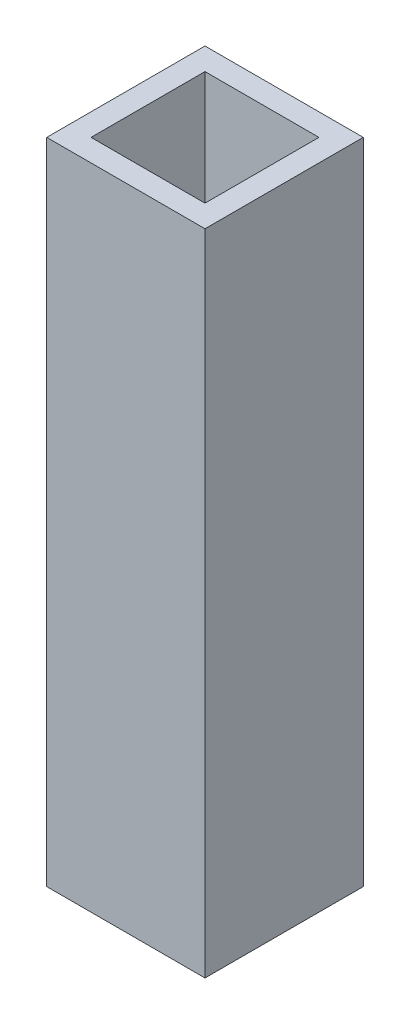
ISO-10303-21;
HEADER;
FILE_DESCRIPTION(('STEP AP214'),'2;1');
FILE_NAME('part.step','',(''),(''),'','','');
FILE_SCHEMA(('AUTOMOTIVE_DESIGN { 1 0 10303 214 1 1 1 1 }'));
ENDSEC;
DATA;
#1=APPLICATION_CONTEXT('core data for automotive mechanical design processes');
#2=APPLICATION_PROTOCOL_DEFINITION('international standard','automotive_design',2000,#1);
#3=PRODUCT_CONTEXT('',#1,'mechanical');
#4=PRODUCT('Part','Part','',(#3));
#5=PRODUCT_RELATED_PRODUCT_CATEGORY('part','',(#4));
#6=PRODUCT_DEFINITION_FORMATION('','',#4);
#7=PRODUCT_DEFINITION_CONTEXT('part definition',#1,'design');
#8=PRODUCT_DEFINITION('design','',#6,#7);
#9=PRODUCT_DEFINITION_SHAPE('','',#8);
#10=(LENGTH_UNIT() NAMED_UNIT(*) SI_UNIT(.MILLI.,.METRE.));
#11=(NAMED_UNIT(*) PLANE_ANGLE_UNIT() SI_UNIT($,.RADIAN.));
#12=(NAMED_UNIT(*) SI_UNIT($,.STERADIAN.) SOLID_ANGLE_UNIT());
#13=UNCERTAINTY_MEASURE_WITH_UNIT(LENGTH_MEASURE(1.E-05),#10,'distance_accuracy_value','');
#14=(GEOMETRIC_REPRESENTATION_CONTEXT(3) GLOBAL_UNCERTAINTY_ASSIGNED_CONTEXT((#13)) GLOBAL_UNIT_ASSIGNED_CONTEXT((#10,
#11,#12)) REPRESENTATION_CONTEXT('',''));
#15=CARTESIAN_POINT('',(0.,0.,0.));
#16=DIRECTION('',(0.,0.,1.));
#17=DIRECTION('',(1.,0.,0.));
#18=AXIS2_PLACEMENT_3D('',#15,#16,#17);
#19=CARTESIAN_POINT('',(0.,205.,0.));
#20=DIRECTION('',(0.,1.,0.));
#21=DIRECTION('',(0.,0.,1.));
#22=AXIS2_PLACEMENT_3D('',#19,#20,#21);
#23=PLANE('',#22);
#24=DIRECTION('',(0.,0.,-1.));
#25=VECTOR('',#24,1.);
#26=CARTESIAN_POINT('',(25.,205.,-25.));
#27=LINE('',#26,#25);
#28=CARTESIAN_POINT('',(25.,205.,25.));
#29=VERTEX_POINT('',#28);
#30=CARTESIAN_POINT('',(25.,205.,-25.));
#31=VERTEX_POINT('',#30);
#32=EDGE_CURVE('E153',#29,#31,#27,.T.);
#33=ORIENTED_EDGE('',*,*,#32,.T.);
#34=DIRECTION('',(-1.,0.,0.));
#35=VECTOR('',#34,1.);
#36=CARTESIAN_POINT('',(-25.,205.,-25.));
#37=LINE('',#36,#35);
#38=CARTESIAN_POINT('',(-25.,205.,-25.));
#39=VERTEX_POINT('',#38);
#40=EDGE_CURVE('E157',#31,#39,#37,.T.);
#41=ORIENTED_EDGE('',*,*,#40,.T.);
#42=DIRECTION('',(0.,0.,1.));
#43=VECTOR('',#42,1.);
#44=CARTESIAN_POINT('',(-25.,205.,-25.));
#45=LINE('',#44,#43);
#46=CARTESIAN_POINT('',(-25.,205.,25.));
#47=VERTEX_POINT('',#46);
#48=EDGE_CURVE('E161',#39,#47,#45,.T.);
#49=ORIENTED_EDGE('',*,*,#48,.T.);
#50=DIRECTION('',(1.,0.,0.));
#51=VECTOR('',#50,1.);
#52=CARTESIAN_POINT('',(-25.,205.,25.));
#53=LINE('',#52,#51);
#54=EDGE_CURVE('E164',#47,#29,#53,.T.);
#55=ORIENTED_EDGE('',*,*,#54,.T.);
#56=EDGE_LOOP('',(#33,#41,#49,#55));
#57=FACE_BOUND('',#56,.T.);
#58=DIRECTION('',(1.,0.,0.));
#59=VECTOR('',#58,1.);
#60=CARTESIAN_POINT('',(-18.,205.,18.));
#61=LINE('',#60,#59);
#62=CARTESIAN_POINT('',(-18.,205.,18.));
#63=VERTEX_POINT('',#62);
#64=CARTESIAN_POINT('',(18.,205.,18.));
#65=VERTEX_POINT('',#64);
#66=EDGE_CURVE('E114',#63,#65,#61,.T.);
#67=ORIENTED_EDGE('',*,*,#66,.F.);
#68=DIRECTION('',(0.,0.,1.));
#69=VECTOR('',#68,1.);
#70=CARTESIAN_POINT('',(-18.,205.,-18.));
#71=LINE('',#70,#69);
#72=CARTESIAN_POINT('',(-18.,205.,-18.));
#73=VERTEX_POINT('',#72);
#74=EDGE_CURVE('E105',#73,#63,#71,.T.);
#75=ORIENTED_EDGE('',*,*,#74,.F.);
#76=DIRECTION('',(-1.,0.,0.));
#77=VECTOR('',#76,1.);
#78=CARTESIAN_POINT('',(-18.,205.,-18.));
#79=LINE('',#78,#77);
#80=CARTESIAN_POINT('',(18.,205.,-18.));
#81=VERTEX_POINT('',#80);
#82=EDGE_CURVE('E131',#81,#73,#79,.T.);
#83=ORIENTED_EDGE('',*,*,#82,.F.);
#84=DIRECTION('',(0.,0.,-1.));
#85=VECTOR('',#84,1.);
#86=CARTESIAN_POINT('',(18.,205.,-18.));
#87=LINE('',#86,#85);
#88=EDGE_CURVE('E127',#65,#81,#87,.T.);
#89=ORIENTED_EDGE('',*,*,#88,.F.);
#90=EDGE_LOOP('',(#67,#75,#83,#89));
#91=FACE_BOUND('',#90,.T.);
#92=ADVANCED_FACE('F39',(#57,#91),#23,.T.);
#93=CARTESIAN_POINT('',(0.,0.,0.));
#94=DIRECTION('',(0.,1.,0.));
#95=DIRECTION('',(0.,0.,1.));
#96=AXIS2_PLACEMENT_3D('',#93,#94,#95);
#97=PLANE('',#96);
#98=DIRECTION('',(0.,0.,-1.));
#99=VECTOR('',#98,1.);
#100=CARTESIAN_POINT('',(25.,0.,-25.));
#101=LINE('',#100,#99);
#102=CARTESIAN_POINT('',(25.,0.,25.));
#103=VERTEX_POINT('',#102);
#104=CARTESIAN_POINT('',(25.,0.,-25.));
#105=VERTEX_POINT('',#104);
#106=EDGE_CURVE('E123',#103,#105,#101,.T.);
#107=ORIENTED_EDGE('',*,*,#106,.F.);
#108=DIRECTION('',(1.,0.,0.));
#109=VECTOR('',#108,1.);
#110=CARTESIAN_POINT('',(-25.,0.,25.));
#111=LINE('',#110,#109);
#112=CARTESIAN_POINT('',(-25.,0.,25.));
#113=VERTEX_POINT('',#112);
#114=EDGE_CURVE('E158',#113,#103,#111,.T.);
#115=ORIENTED_EDGE('',*,*,#114,.F.);
#116=DIRECTION('',(0.,0.,1.));
#117=VECTOR('',#116,1.);
#118=CARTESIAN_POINT('',(-25.,0.,-25.));
#119=LINE('',#118,#117);
#120=CARTESIAN_POINT('',(-25.,0.,-25.));
#121=VERTEX_POINT('',#120);
#122=EDGE_CURVE('E174',#121,#113,#119,.T.);
#123=ORIENTED_EDGE('',*,*,#122,.F.);
#124=DIRECTION('',(-1.,0.,0.));
#125=VECTOR('',#124,1.);
#126=CARTESIAN_POINT('',(-25.,0.,-25.));
#127=LINE('',#126,#125);
#128=EDGE_CURVE('E171',#105,#121,#127,.T.);
#129=ORIENTED_EDGE('',*,*,#128,.F.);
#130=EDGE_LOOP('',(#107,#115,#123,#129));
#131=FACE_BOUND('',#130,.T.);
#132=DIRECTION('',(0.,0.,1.));
#133=VECTOR('',#132,1.);
#134=CARTESIAN_POINT('',(-18.,0.,-18.));
#135=LINE('',#134,#133);
#136=CARTESIAN_POINT('',(-18.,0.,-18.));
#137=VERTEX_POINT('',#136);
#138=CARTESIAN_POINT('',(-18.,0.,18.));
#139=VERTEX_POINT('',#138);
#140=EDGE_CURVE('E63',#137,#139,#135,.T.);
#141=ORIENTED_EDGE('',*,*,#140,.T.);
#142=DIRECTION('',(1.,0.,0.));
#143=VECTOR('',#142,1.);
#144=CARTESIAN_POINT('',(-18.,0.,18.));
#145=LINE('',#144,#143);
#146=CARTESIAN_POINT('',(18.,0.,18.));
#147=VERTEX_POINT('',#146);
#148=EDGE_CURVE('E121',#139,#147,#145,.T.);
#149=ORIENTED_EDGE('',*,*,#148,.T.);
#150=DIRECTION('',(0.,0.,-1.));
#151=VECTOR('',#150,1.);
#152=CARTESIAN_POINT('',(18.,0.,-18.));
#153=LINE('',#152,#151);
#154=CARTESIAN_POINT('',(18.,0.,-18.));
#155=VERTEX_POINT('',#154);
#156=EDGE_CURVE('E140',#147,#155,#153,.T.);
#157=ORIENTED_EDGE('',*,*,#156,.T.);
#158=DIRECTION('',(-1.,0.,0.));
#159=VECTOR('',#158,1.);
#160=CARTESIAN_POINT('',(-18.,0.,-18.));
#161=LINE('',#160,#159);
#162=EDGE_CURVE('E115',#155,#137,#161,.T.);
#163=ORIENTED_EDGE('',*,*,#162,.T.);
#164=EDGE_LOOP('',(#141,#149,#157,#163));
#165=FACE_BOUND('',#164,.T.);
#166=ADVANCED_FACE('F197',(#131,#165),#97,.F.);
#167=CARTESIAN_POINT('',(25.,205.,-25.));
#168=DIRECTION('',(-1.,0.,0.));
#169=DIRECTION('',(0.,0.,1.));
#170=AXIS2_PLACEMENT_3D('',#167,#168,#169);
#171=PLANE('',#170);
#172=ORIENTED_EDGE('',*,*,#106,.T.);
#173=DIRECTION('',(0.,-1.,0.));
#174=VECTOR('',#173,1.);
#175=CARTESIAN_POINT('',(25.,205.,-25.));
#176=LINE('',#175,#174);
#177=EDGE_CURVE('E11',#31,#105,#176,.T.);
#178=ORIENTED_EDGE('',*,*,#177,.F.);
#179=ORIENTED_EDGE('',*,*,#32,.F.);
#180=DIRECTION('',(0.,-1.,0.));
#181=VECTOR('',#180,1.);
#182=CARTESIAN_POINT('',(25.,205.,25.));
#183=LINE('',#182,#181);
#184=EDGE_CURVE('E167',#29,#103,#183,.T.);
#185=ORIENTED_EDGE('',*,*,#184,.T.);
#186=EDGE_LOOP('',(#172,#178,#179,#185));
#187=FACE_BOUND('',#186,.T.);
#188=ADVANCED_FACE('F41',(#187),#171,.F.);
#189=CARTESIAN_POINT('',(-25.,205.,-25.));
#190=DIRECTION('',(0.,0.,1.));
#191=DIRECTION('',(1.,0.,0.));
#192=AXIS2_PLACEMENT_3D('',#189,#190,#191);
#193=PLANE('',#192);
#194=ORIENTED_EDGE('',*,*,#128,.T.);
#195=DIRECTION('',(0.,-1.,0.));
#196=VECTOR('',#195,1.);
#197=CARTESIAN_POINT('',(-25.,205.,-25.));
#198=LINE('',#197,#196);
#199=EDGE_CURVE('E48',#39,#121,#198,.T.);
#200=ORIENTED_EDGE('',*,*,#199,.F.);
#201=ORIENTED_EDGE('',*,*,#40,.F.);
#202=ORIENTED_EDGE('',*,*,#177,.T.);
#203=EDGE_LOOP('',(#194,#200,#201,#202));
#204=FACE_BOUND('',#203,.T.);
#205=ADVANCED_FACE('F207',(#204),#193,.F.);
#206=CARTESIAN_POINT('',(-25.,205.,-25.));
#207=DIRECTION('',(1.,0.,0.));
#208=DIRECTION('',(0.,0.,-1.));
#209=AXIS2_PLACEMENT_3D('',#206,#207,#208);
#210=PLANE('',#209);
#211=ORIENTED_EDGE('',*,*,#122,.T.);
#212=DIRECTION('',(0.,-1.,0.));
#213=VECTOR('',#212,1.);
#214=CARTESIAN_POINT('',(-25.,205.,25.));
#215=LINE('',#214,#213);
#216=EDGE_CURVE('E182',#47,#113,#215,.T.);
#217=ORIENTED_EDGE('',*,*,#216,.F.);
#218=ORIENTED_EDGE('',*,*,#48,.F.);
#219=ORIENTED_EDGE('',*,*,#199,.T.);
#220=EDGE_LOOP('',(#211,#217,#218,#219));
#221=FACE_BOUND('',#220,.T.);
#222=ADVANCED_FACE('F191',(#221),#210,.F.);
#223=CARTESIAN_POINT('',(-25.,205.,25.));
#224=DIRECTION('',(0.,0.,-1.));
#225=DIRECTION('',(-1.,0.,0.));
#226=AXIS2_PLACEMENT_3D('',#223,#224,#225);
#227=PLANE('',#226);
#228=ORIENTED_EDGE('',*,*,#114,.T.);
#229=ORIENTED_EDGE('',*,*,#184,.F.);
#230=ORIENTED_EDGE('',*,*,#54,.F.);
#231=ORIENTED_EDGE('',*,*,#216,.T.);
#232=EDGE_LOOP('',(#228,#229,#230,#231));
#233=FACE_BOUND('',#232,.T.);
#234=ADVANCED_FACE('F201',(#233),#227,.F.);
#235=CARTESIAN_POINT('',(-18.,205.,-18.));
#236=DIRECTION('',(1.,0.,0.));
#237=DIRECTION('',(0.,0.,-1.));
#238=AXIS2_PLACEMENT_3D('',#235,#236,#237);
#239=PLANE('',#238);
#240=ORIENTED_EDGE('',*,*,#140,.F.);
#241=DIRECTION('',(0.,-1.,0.));
#242=VECTOR('',#241,1.);
#243=CARTESIAN_POINT('',(-18.,205.,-18.));
#244=LINE('',#243,#242);
#245=EDGE_CURVE('E109',#73,#137,#244,.T.);
#246=ORIENTED_EDGE('',*,*,#245,.F.);
#247=ORIENTED_EDGE('',*,*,#74,.T.);
#248=DIRECTION('',(0.,-1.,0.));
#249=VECTOR('',#248,1.);
#250=CARTESIAN_POINT('',(-18.,205.,18.));
#251=LINE('',#250,#249);
#252=EDGE_CURVE('E108',#63,#139,#251,.T.);
#253=ORIENTED_EDGE('',*,*,#252,.T.);
#254=EDGE_LOOP('',(#240,#246,#247,#253));
#255=FACE_BOUND('',#254,.T.);
#256=ADVANCED_FACE('F107',(#255),#239,.T.);
#257=CARTESIAN_POINT('',(-18.,205.,18.));
#258=DIRECTION('',(0.,0.,-1.));
#259=DIRECTION('',(-1.,0.,0.));
#260=AXIS2_PLACEMENT_3D('',#257,#258,#259);
#261=PLANE('',#260);
#262=ORIENTED_EDGE('',*,*,#148,.F.);
#263=ORIENTED_EDGE('',*,*,#252,.F.);
#264=ORIENTED_EDGE('',*,*,#66,.T.);
#265=DIRECTION('',(0.,-1.,0.));
#266=VECTOR('',#265,1.);
#267=CARTESIAN_POINT('',(18.,205.,18.));
#268=LINE('',#267,#266);
#269=EDGE_CURVE('E124',#65,#147,#268,.T.);
#270=ORIENTED_EDGE('',*,*,#269,.T.);
#271=EDGE_LOOP('',(#262,#263,#264,#270));
#272=FACE_BOUND('',#271,.T.);
#273=ADVANCED_FACE('F118',(#272),#261,.T.);
#274=CARTESIAN_POINT('',(18.,205.,-18.));
#275=DIRECTION('',(-1.,0.,0.));
#276=DIRECTION('',(0.,0.,1.));
#277=AXIS2_PLACEMENT_3D('',#274,#275,#276);
#278=PLANE('',#277);
#279=ORIENTED_EDGE('',*,*,#156,.F.);
#280=ORIENTED_EDGE('',*,*,#269,.F.);
#281=ORIENTED_EDGE('',*,*,#88,.T.);
#282=DIRECTION('',(0.,-1.,0.));
#283=VECTOR('',#282,1.);
#284=CARTESIAN_POINT('',(18.,205.,-18.));
#285=LINE('',#284,#283);
#286=EDGE_CURVE('E55',#81,#155,#285,.T.);
#287=ORIENTED_EDGE('',*,*,#286,.T.);
#288=EDGE_LOOP('',(#279,#280,#281,#287));
#289=FACE_BOUND('',#288,.T.);
#290=ADVANCED_FACE('F230',(#289),#278,.T.);
#291=CARTESIAN_POINT('',(-18.,205.,-18.));
#292=DIRECTION('',(0.,0.,1.));
#293=DIRECTION('',(1.,0.,0.));
#294=AXIS2_PLACEMENT_3D('',#291,#292,#293);
#295=PLANE('',#294);
#296=ORIENTED_EDGE('',*,*,#162,.F.);
#297=ORIENTED_EDGE('',*,*,#286,.F.);
#298=ORIENTED_EDGE('',*,*,#82,.T.);
#299=ORIENTED_EDGE('',*,*,#245,.T.);
#300=EDGE_LOOP('',(#296,#297,#298,#299));
#301=FACE_BOUND('',#300,.T.);
#302=ADVANCED_FACE('F234',(#301),#295,.T.);
#303=CLOSED_SHELL('',(#92,#166,#188,#205,#222,#234,#256,#273,#290,#302));
#304=MANIFOLD_SOLID_BREP('B2',#303);
#305=ADVANCED_BREP_SHAPE_REPRESENTATION('',(#18,#304),#14);
#306=SHAPE_DEFINITION_REPRESENTATION(#9,#305);
ENDSEC;
END-ISO-10303-21;
